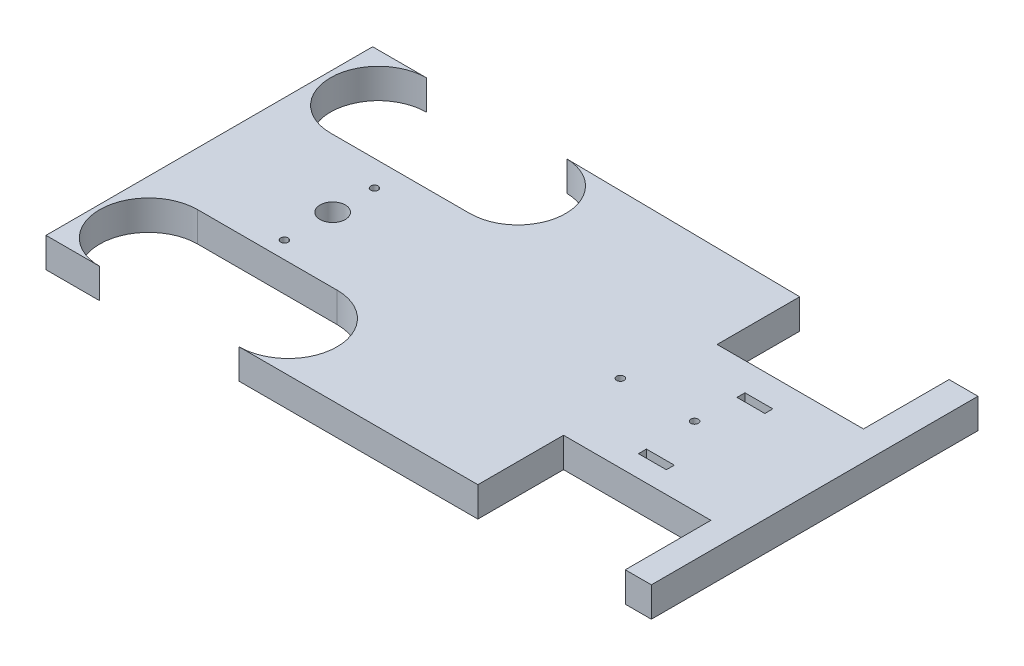
ISO-10303-21;
HEADER;
FILE_DESCRIPTION(('STEP AP214'),'2;1');
FILE_NAME('part.step','',(''),(''),'','','');
FILE_SCHEMA(('AUTOMOTIVE_DESIGN { 1 0 10303 214 1 1 1 1 }'));
ENDSEC;
DATA;
#1=APPLICATION_CONTEXT('core data for automotive mechanical design processes');
#2=APPLICATION_PROTOCOL_DEFINITION('international standard','automotive_design',2000,#1);
#3=PRODUCT_CONTEXT('',#1,'mechanical');
#4=PRODUCT('Part','Part','',(#3));
#5=PRODUCT_RELATED_PRODUCT_CATEGORY('part','',(#4));
#6=PRODUCT_DEFINITION_FORMATION('','',#4);
#7=PRODUCT_DEFINITION_CONTEXT('part definition',#1,'design');
#8=PRODUCT_DEFINITION('design','',#6,#7);
#9=PRODUCT_DEFINITION_SHAPE('','',#8);
#10=(LENGTH_UNIT() NAMED_UNIT(*) SI_UNIT(.MILLI.,.METRE.));
#11=(NAMED_UNIT(*) PLANE_ANGLE_UNIT() SI_UNIT($,.RADIAN.));
#12=(NAMED_UNIT(*) SI_UNIT($,.STERADIAN.) SOLID_ANGLE_UNIT());
#13=UNCERTAINTY_MEASURE_WITH_UNIT(LENGTH_MEASURE(1.E-05),#10,'distance_accuracy_value','');
#14=(GEOMETRIC_REPRESENTATION_CONTEXT(3) GLOBAL_UNCERTAINTY_ASSIGNED_CONTEXT((#13)) GLOBAL_UNIT_ASSIGNED_CONTEXT((#10,
#11,#12)) REPRESENTATION_CONTEXT('',''));
#15=CARTESIAN_POINT('',(0.,0.,0.));
#16=DIRECTION('',(0.,0.,1.));
#17=DIRECTION('',(1.,0.,0.));
#18=AXIS2_PLACEMENT_3D('',#15,#16,#17);
#19=CARTESIAN_POINT('',(0.,4.,6.21194904951244));
#20=DIRECTION('',(0.,0.,1.));
#21=DIRECTION('',(1.,0.,0.));
#22=AXIS2_PLACEMENT_3D('',#19,#20,#21);
#23=PLANE('',#22);
#24=DIRECTION('',(-1.,0.,0.));
#25=VECTOR('',#24,1.);
#26=CARTESIAN_POINT('',(0.,0.,6.21194904951244));
#27=LINE('',#26,#25);
#28=CARTESIAN_POINT('',(-11.8351258503829,0.,6.21194904951244));
#29=VERTEX_POINT('',#28);
#30=CARTESIAN_POINT('',(-30.5325354955565,0.,6.21194904951244));
#31=VERTEX_POINT('',#30);
#32=EDGE_CURVE('E297',#29,#31,#27,.T.);
#33=ORIENTED_EDGE('',*,*,#32,.F.);
#34=DIRECTION('',(0.,-1.,0.));
#35=VECTOR('',#34,1.);
#36=CARTESIAN_POINT('',(-11.8351258503829,4.,6.21194904951244));
#37=LINE('',#36,#35);
#38=CARTESIAN_POINT('',(-11.8351258503829,4.,6.21194904951244));
#39=VERTEX_POINT('',#38);
#40=EDGE_CURVE('E11',#39,#29,#37,.T.);
#41=ORIENTED_EDGE('',*,*,#40,.F.);
#42=DIRECTION('',(-1.,0.,0.));
#43=VECTOR('',#42,1.);
#44=CARTESIAN_POINT('',(0.,4.,6.21194904951244));
#45=LINE('',#44,#43);
#46=CARTESIAN_POINT('',(-30.5325354955565,4.,6.21194904951244));
#47=VERTEX_POINT('',#46);
#48=EDGE_CURVE('E447',#39,#47,#45,.T.);
#49=ORIENTED_EDGE('',*,*,#48,.T.);
#50=DIRECTION('',(0.,-1.,0.));
#51=VECTOR('',#50,1.);
#52=CARTESIAN_POINT('',(-30.5325354955565,4.,6.21194904951244));
#53=LINE('',#52,#51);
#54=EDGE_CURVE('E56',#47,#31,#53,.T.);
#55=ORIENTED_EDGE('',*,*,#54,.T.);
#56=EDGE_LOOP('',(#33,#41,#49,#55));
#57=FACE_BOUND('',#56,.T.);
#58=ADVANCED_FACE('F37',(#57),#23,.T.);
#59=CARTESIAN_POINT('',(-11.8351258503829,4.,12.7885616624354));
#60=DIRECTION('',(0.,-1.,0.));
#61=DIRECTION('',(0.,0.,-1.));
#62=AXIS2_PLACEMENT_3D('',#59,#60,#61);
#63=CYLINDRICAL_SURFACE('',#62,6.57661261292298);
#64=CARTESIAN_POINT('',(-11.8351258503829,0.,12.7885616624354));
#65=DIRECTION('',(0.,1.,0.));
#66=DIRECTION('',(0.,0.,1.));
#67=AXIS2_PLACEMENT_3D('',#64,#65,#66);
#68=CIRCLE('',#67,6.57661261292298);
#69=CARTESIAN_POINT('',(-11.8351258503829,0.,19.3651742753584));
#70=VERTEX_POINT('',#69);
#71=EDGE_CURVE('E299',#29,#70,#68,.F.);
#72=ORIENTED_EDGE('',*,*,#71,.T.);
#73=DIRECTION('',(0.,-1.,0.));
#74=VECTOR('',#73,1.);
#75=CARTESIAN_POINT('',(-11.8351258503829,4.,19.3651742753584));
#76=LINE('',#75,#74);
#77=CARTESIAN_POINT('',(-11.8351258503829,4.,19.3651742753584));
#78=VERTEX_POINT('',#77);
#79=EDGE_CURVE('E47',#78,#70,#76,.T.);
#80=ORIENTED_EDGE('',*,*,#79,.F.);
#81=CARTESIAN_POINT('',(-11.8351258503829,4.,12.7885616624354));
#82=DIRECTION('',(0.,1.,0.));
#83=DIRECTION('',(0.,0.,1.));
#84=AXIS2_PLACEMENT_3D('',#81,#82,#83);
#85=CIRCLE('',#84,6.57661261292298);
#86=EDGE_CURVE('E449',#39,#78,#85,.F.);
#87=ORIENTED_EDGE('',*,*,#86,.F.);
#88=ORIENTED_EDGE('',*,*,#40,.T.);
#89=EDGE_LOOP('',(#72,#80,#87,#88));
#90=FACE_BOUND('',#89,.T.);
#91=ADVANCED_FACE('F509',(#90),#63,.F.);
#92=CARTESIAN_POINT('',(0.,4.,19.3651742753584));
#93=DIRECTION('',(0.,0.,-1.));
#94=DIRECTION('',(-1.,0.,0.));
#95=AXIS2_PLACEMENT_3D('',#92,#93,#94);
#96=PLANE('',#95);
#97=DIRECTION('',(1.,0.,0.));
#98=VECTOR('',#97,1.);
#99=CARTESIAN_POINT('',(0.,0.,19.3651742753584));
#100=LINE('',#99,#98);
#101=CARTESIAN_POINT('',(20.1933701419725,0.,19.3651742753584));
#102=VERTEX_POINT('',#101);
#103=EDGE_CURVE('E302',#70,#102,#100,.T.);
#104=ORIENTED_EDGE('',*,*,#103,.T.);
#105=DIRECTION('',(0.,-1.,0.));
#106=VECTOR('',#105,1.);
#107=CARTESIAN_POINT('',(20.1933701419725,4.,19.3651742753584));
#108=LINE('',#107,#106);
#109=CARTESIAN_POINT('',(20.1933701419725,4.,19.3651742753584));
#110=VERTEX_POINT('',#109);
#111=EDGE_CURVE('E388',#110,#102,#108,.T.);
#112=ORIENTED_EDGE('',*,*,#111,.F.);
#113=DIRECTION('',(1.,0.,0.));
#114=VECTOR('',#113,1.);
#115=CARTESIAN_POINT('',(0.,4.,19.3651742753584));
#116=LINE('',#115,#114);
#117=EDGE_CURVE('E452',#78,#110,#116,.T.);
#118=ORIENTED_EDGE('',*,*,#117,.F.);
#119=ORIENTED_EDGE('',*,*,#79,.T.);
#120=EDGE_LOOP('',(#104,#112,#118,#119));
#121=FACE_BOUND('',#120,.T.);
#122=ADVANCED_FACE('F514',(#121),#96,.F.);
#123=CARTESIAN_POINT('',(20.1933701419725,4.,0.));
#124=DIRECTION('',(1.,0.,0.));
#125=DIRECTION('',(0.,0.,-1.));
#126=AXIS2_PLACEMENT_3D('',#123,#124,#125);
#127=PLANE('',#126);
#128=DIRECTION('',(0.,0.,1.));
#129=VECTOR('',#128,1.);
#130=CARTESIAN_POINT('',(20.1933701419725,0.,0.));
#131=LINE('',#130,#129);
#132=CARTESIAN_POINT('',(20.1933701419725,0.,7.87962263618029));
#133=VERTEX_POINT('',#132);
#134=EDGE_CURVE('E305',#133,#102,#131,.T.);
#135=ORIENTED_EDGE('',*,*,#134,.F.);
#136=DIRECTION('',(0.,-1.,0.));
#137=VECTOR('',#136,1.);
#138=CARTESIAN_POINT('',(20.1933701419725,4.,7.87962263618029));
#139=LINE('',#138,#137);
#140=CARTESIAN_POINT('',(20.1933701419725,4.,7.87962263618029));
#141=VERTEX_POINT('',#140);
#142=EDGE_CURVE('E386',#141,#133,#139,.T.);
#143=ORIENTED_EDGE('',*,*,#142,.F.);
#144=DIRECTION('',(0.,0.,1.));
#145=VECTOR('',#144,1.);
#146=CARTESIAN_POINT('',(20.1933701419725,4.,0.));
#147=LINE('',#146,#145);
#148=EDGE_CURVE('E454',#141,#110,#147,.T.);
#149=ORIENTED_EDGE('',*,*,#148,.T.);
#150=ORIENTED_EDGE('',*,*,#111,.T.);
#151=EDGE_LOOP('',(#135,#143,#149,#150));
#152=FACE_BOUND('',#151,.T.);
#153=ADVANCED_FACE('F794',(#152),#127,.T.);
#154=CARTESIAN_POINT('',(0.,4.,7.87962263618029));
#155=DIRECTION('',(0.,0.,1.));
#156=DIRECTION('',(1.,0.,0.));
#157=AXIS2_PLACEMENT_3D('',#154,#155,#156);
#158=PLANE('',#157);
#159=DIRECTION('',(-1.,0.,0.));
#160=VECTOR('',#159,1.);
#161=CARTESIAN_POINT('',(0.,0.,7.87962263618029));
#162=LINE('',#161,#160);
#163=CARTESIAN_POINT('',(39.9592031954417,0.,7.87962263618029));
#164=VERTEX_POINT('',#163);
#165=EDGE_CURVE('E308',#164,#133,#162,.T.);
#166=ORIENTED_EDGE('',*,*,#165,.F.);
#167=DIRECTION('',(0.,-1.,0.));
#168=VECTOR('',#167,1.);
#169=CARTESIAN_POINT('',(39.9592031954417,4.,7.87962263618029));
#170=LINE('',#169,#168);
#171=CARTESIAN_POINT('',(39.9592031954417,4.,7.87962263618029));
#172=VERTEX_POINT('',#171);
#173=EDGE_CURVE('E384',#172,#164,#170,.T.);
#174=ORIENTED_EDGE('',*,*,#173,.F.);
#175=DIRECTION('',(-1.,0.,0.));
#176=VECTOR('',#175,1.);
#177=CARTESIAN_POINT('',(0.,4.,7.87962263618029));
#178=LINE('',#177,#176);
#179=EDGE_CURVE('E457',#172,#141,#178,.T.);
#180=ORIENTED_EDGE('',*,*,#179,.T.);
#181=ORIENTED_EDGE('',*,*,#142,.T.);
#182=EDGE_LOOP('',(#166,#174,#180,#181));
#183=FACE_BOUND('',#182,.T.);
#184=ADVANCED_FACE('F785',(#183),#158,.T.);
#185=CARTESIAN_POINT('',(39.9592031954417,4.,0.));
#186=DIRECTION('',(1.,0.,0.));
#187=DIRECTION('',(0.,0.,-1.));
#188=AXIS2_PLACEMENT_3D('',#185,#186,#187);
#189=PLANE('',#188);
#190=DIRECTION('',(0.,0.,1.));
#191=VECTOR('',#190,1.);
#192=CARTESIAN_POINT('',(39.9592031954417,0.,0.));
#193=LINE('',#192,#191);
#194=CARTESIAN_POINT('',(39.9592031954418,0.,19.3651742753584));
#195=VERTEX_POINT('',#194);
#196=EDGE_CURVE('E311',#164,#195,#193,.T.);
#197=ORIENTED_EDGE('',*,*,#196,.T.);
#198=DIRECTION('',(0.,-1.,0.));
#199=VECTOR('',#198,1.);
#200=CARTESIAN_POINT('',(39.9592031954418,4.,19.3651742753584));
#201=LINE('',#200,#199);
#202=CARTESIAN_POINT('',(39.9592031954418,4.,19.3651742753584));
#203=VERTEX_POINT('',#202);
#204=EDGE_CURVE('E381',#203,#195,#201,.T.);
#205=ORIENTED_EDGE('',*,*,#204,.F.);
#206=DIRECTION('',(0.,0.,1.));
#207=VECTOR('',#206,1.);
#208=CARTESIAN_POINT('',(39.9592031954417,4.,0.));
#209=LINE('',#208,#207);
#210=EDGE_CURVE('E460',#172,#203,#209,.T.);
#211=ORIENTED_EDGE('',*,*,#210,.F.);
#212=ORIENTED_EDGE('',*,*,#173,.T.);
#213=EDGE_LOOP('',(#197,#205,#211,#212));
#214=FACE_BOUND('',#213,.T.);
#215=ADVANCED_FACE('F776',(#214),#189,.F.);
#216=CARTESIAN_POINT('',(0.,4.,19.3651742753582));
#217=DIRECTION('',(0.,0.,-1.));
#218=DIRECTION('',(-1.,0.,0.));
#219=AXIS2_PLACEMENT_3D('',#216,#217,#218);
#220=PLANE('',#219);
#221=DIRECTION('',(1.,0.,0.));
#222=VECTOR('',#221,1.);
#223=CARTESIAN_POINT('',(0.,0.,19.3651742753582));
#224=LINE('',#223,#222);
#225=CARTESIAN_POINT('',(43.4557855289163,0.,19.3651742753584));
#226=VERTEX_POINT('',#225);
#227=EDGE_CURVE('E314',#195,#226,#224,.T.);
#228=ORIENTED_EDGE('',*,*,#227,.T.);
#229=DIRECTION('',(0.,-1.,0.));
#230=VECTOR('',#229,1.);
#231=CARTESIAN_POINT('',(43.4557855289163,4.,19.3651742753584));
#232=LINE('',#231,#230);
#233=CARTESIAN_POINT('',(43.4557855289163,4.,19.3651742753584));
#234=VERTEX_POINT('',#233);
#235=EDGE_CURVE('E379',#234,#226,#232,.T.);
#236=ORIENTED_EDGE('',*,*,#235,.F.);
#237=DIRECTION('',(1.,0.,0.));
#238=VECTOR('',#237,1.);
#239=CARTESIAN_POINT('',(0.,4.,19.3651742753582));
#240=LINE('',#239,#238);
#241=EDGE_CURVE('E463',#203,#234,#240,.T.);
#242=ORIENTED_EDGE('',*,*,#241,.F.);
#243=ORIENTED_EDGE('',*,*,#204,.T.);
#244=EDGE_LOOP('',(#228,#236,#242,#243));
#245=FACE_BOUND('',#244,.T.);
#246=ADVANCED_FACE('F767',(#245),#220,.F.);
#247=CARTESIAN_POINT('',(43.4557855289163,4.,0.));
#248=DIRECTION('',(1.,0.,0.));
#249=DIRECTION('',(0.,0.,-1.));
#250=AXIS2_PLACEMENT_3D('',#247,#248,#249);
#251=PLANE('',#250);
#252=DIRECTION('',(0.,0.,1.));
#253=VECTOR('',#252,1.);
#254=CARTESIAN_POINT('',(43.4557855289163,0.,0.));
#255=LINE('',#254,#253);
#256=CARTESIAN_POINT('',(43.4557855289163,0.,-24.4401854647627));
#257=VERTEX_POINT('',#256);
#258=EDGE_CURVE('E317',#257,#226,#255,.T.);
#259=ORIENTED_EDGE('',*,*,#258,.F.);
#260=DIRECTION('',(0.,-1.,0.));
#261=VECTOR('',#260,1.);
#262=CARTESIAN_POINT('',(43.4557855289163,4.,-24.4401854647627));
#263=LINE('',#262,#261);
#264=CARTESIAN_POINT('',(43.4557855289163,4.,-24.4401854647627));
#265=VERTEX_POINT('',#264);
#266=EDGE_CURVE('E377',#265,#257,#263,.T.);
#267=ORIENTED_EDGE('',*,*,#266,.F.);
#268=DIRECTION('',(0.,0.,1.));
#269=VECTOR('',#268,1.);
#270=CARTESIAN_POINT('',(43.4557855289163,4.,0.));
#271=LINE('',#270,#269);
#272=EDGE_CURVE('E465',#265,#234,#271,.T.);
#273=ORIENTED_EDGE('',*,*,#272,.T.);
#274=ORIENTED_EDGE('',*,*,#235,.T.);
#275=EDGE_LOOP('',(#259,#267,#273,#274));
#276=FACE_BOUND('',#275,.T.);
#277=ADVANCED_FACE('F758',(#276),#251,.T.);
#278=CARTESIAN_POINT('',(0.,4.,-24.4401854647627));
#279=DIRECTION('',(0.,0.,-1.));
#280=DIRECTION('',(-1.,0.,0.));
#281=AXIS2_PLACEMENT_3D('',#278,#279,#280);
#282=PLANE('',#281);
#283=DIRECTION('',(1.,0.,0.));
#284=VECTOR('',#283,1.);
#285=CARTESIAN_POINT('',(0.,0.,-24.4401854647627));
#286=LINE('',#285,#284);
#287=CARTESIAN_POINT('',(39.5766129964993,0.,-24.4401854647627));
#288=VERTEX_POINT('',#287);
#289=EDGE_CURVE('E320',#288,#257,#286,.T.);
#290=ORIENTED_EDGE('',*,*,#289,.F.);
#291=DIRECTION('',(0.,-1.,0.));
#292=VECTOR('',#291,1.);
#293=CARTESIAN_POINT('',(39.5766129964993,4.,-24.4401854647627));
#294=LINE('',#293,#292);
#295=CARTESIAN_POINT('',(39.5766129964993,4.,-24.4401854647627));
#296=VERTEX_POINT('',#295);
#297=EDGE_CURVE('E375',#296,#288,#294,.T.);
#298=ORIENTED_EDGE('',*,*,#297,.F.);
#299=DIRECTION('',(1.,0.,0.));
#300=VECTOR('',#299,1.);
#301=CARTESIAN_POINT('',(0.,4.,-24.4401854647627));
#302=LINE('',#301,#300);
#303=EDGE_CURVE('E468',#296,#265,#302,.T.);
#304=ORIENTED_EDGE('',*,*,#303,.T.);
#305=ORIENTED_EDGE('',*,*,#266,.T.);
#306=EDGE_LOOP('',(#290,#298,#304,#305));
#307=FACE_BOUND('',#306,.T.);
#308=ADVANCED_FACE('F749',(#307),#282,.T.);
#309=CARTESIAN_POINT('',(39.5766129964993,4.,0.));
#310=DIRECTION('',(1.,0.,0.));
#311=DIRECTION('',(0.,0.,-1.));
#312=AXIS2_PLACEMENT_3D('',#309,#310,#311);
#313=PLANE('',#312);
#314=DIRECTION('',(0.,0.,1.));
#315=VECTOR('',#314,1.);
#316=CARTESIAN_POINT('',(39.5766129964993,0.,0.));
#317=LINE('',#316,#315);
#318=CARTESIAN_POINT('',(39.5766129964993,0.,-12.9607689534621));
#319=VERTEX_POINT('',#318);
#320=EDGE_CURVE('E323',#288,#319,#317,.T.);
#321=ORIENTED_EDGE('',*,*,#320,.T.);
#322=DIRECTION('',(0.,-1.,0.));
#323=VECTOR('',#322,1.);
#324=CARTESIAN_POINT('',(39.5766129964993,4.,-12.9607689534621));
#325=LINE('',#324,#323);
#326=CARTESIAN_POINT('',(39.5766129964993,4.,-12.9607689534621));
#327=VERTEX_POINT('',#326);
#328=EDGE_CURVE('E372',#327,#319,#325,.T.);
#329=ORIENTED_EDGE('',*,*,#328,.F.);
#330=DIRECTION('',(0.,0.,1.));
#331=VECTOR('',#330,1.);
#332=CARTESIAN_POINT('',(39.5766129964993,4.,0.));
#333=LINE('',#332,#331);
#334=EDGE_CURVE('E471',#296,#327,#333,.T.);
#335=ORIENTED_EDGE('',*,*,#334,.F.);
#336=ORIENTED_EDGE('',*,*,#297,.T.);
#337=EDGE_LOOP('',(#321,#329,#335,#336));
#338=FACE_BOUND('',#337,.T.);
#339=ADVANCED_FACE('F740',(#338),#313,.F.);
#340=CARTESIAN_POINT('',(0.,4.,-12.9607689534621));
#341=DIRECTION('',(0.,0.,1.));
#342=DIRECTION('',(1.,0.,0.));
#343=AXIS2_PLACEMENT_3D('',#340,#341,#342);
#344=PLANE('',#343);
#345=DIRECTION('',(-1.,0.,0.));
#346=VECTOR('',#345,1.);
#347=CARTESIAN_POINT('',(0.,0.,-12.9607689534621));
#348=LINE('',#347,#346);
#349=CARTESIAN_POINT('',(19.9504705464123,0.,-12.9607689534621));
#350=VERTEX_POINT('',#349);
#351=EDGE_CURVE('E326',#319,#350,#348,.T.);
#352=ORIENTED_EDGE('',*,*,#351,.T.);
#353=DIRECTION('',(0.,-1.,0.));
#354=VECTOR('',#353,1.);
#355=CARTESIAN_POINT('',(19.9504705464123,4.,-12.9607689534621));
#356=LINE('',#355,#354);
#357=CARTESIAN_POINT('',(19.9504705464123,4.,-12.9607689534621));
#358=VERTEX_POINT('',#357);
#359=EDGE_CURVE('E370',#358,#350,#356,.T.);
#360=ORIENTED_EDGE('',*,*,#359,.F.);
#361=DIRECTION('',(-1.,0.,0.));
#362=VECTOR('',#361,1.);
#363=CARTESIAN_POINT('',(0.,4.,-12.9607689534621));
#364=LINE('',#363,#362);
#365=EDGE_CURVE('E474',#327,#358,#364,.T.);
#366=ORIENTED_EDGE('',*,*,#365,.F.);
#367=ORIENTED_EDGE('',*,*,#328,.T.);
#368=EDGE_LOOP('',(#352,#360,#366,#367));
#369=FACE_BOUND('',#368,.T.);
#370=ADVANCED_FACE('F731',(#369),#344,.F.);
#371=CARTESIAN_POINT('',(19.9504705464123,4.,0.));
#372=DIRECTION('',(1.,0.,0.));
#373=DIRECTION('',(0.,0.,-1.));
#374=AXIS2_PLACEMENT_3D('',#371,#372,#373);
#375=PLANE('',#374);
#376=DIRECTION('',(0.,0.,1.));
#377=VECTOR('',#376,1.);
#378=CARTESIAN_POINT('',(19.9504705464123,0.,0.));
#379=LINE('',#378,#377);
#380=CARTESIAN_POINT('',(19.9504705464123,0.,-24.0395266866518));
#381=VERTEX_POINT('',#380);
#382=EDGE_CURVE('E329',#381,#350,#379,.T.);
#383=ORIENTED_EDGE('',*,*,#382,.F.);
#384=DIRECTION('',(0.,-1.,0.));
#385=VECTOR('',#384,1.);
#386=CARTESIAN_POINT('',(19.9504705464123,4.,-24.0395266866518));
#387=LINE('',#386,#385);
#388=CARTESIAN_POINT('',(19.9504705464123,4.,-24.0395266866518));
#389=VERTEX_POINT('',#388);
#390=EDGE_CURVE('E368',#389,#381,#387,.T.);
#391=ORIENTED_EDGE('',*,*,#390,.F.);
#392=DIRECTION('',(0.,0.,1.));
#393=VECTOR('',#392,1.);
#394=CARTESIAN_POINT('',(19.9504705464123,4.,0.));
#395=LINE('',#394,#393);
#396=EDGE_CURVE('E476',#389,#358,#395,.T.);
#397=ORIENTED_EDGE('',*,*,#396,.T.);
#398=ORIENTED_EDGE('',*,*,#359,.T.);
#399=EDGE_LOOP('',(#383,#391,#397,#398));
#400=FACE_BOUND('',#399,.T.);
#401=ADVANCED_FACE('F722',(#400),#375,.T.);
#402=CARTESIAN_POINT('',(0.306140474276511,4.,-24.2871442926031));
#403=DIRECTION('',(-0.0126040407469354,0.,0.999920565923539));
#404=DIRECTION('',(0.999920565923539,0.,0.0126040407469354));
#405=AXIS2_PLACEMENT_3D('',#402,#403,#404);
#406=PLANE('',#405);
#407=DIRECTION('',(-0.999920565923539,0.,-0.0126040407469354));
#408=VECTOR('',#407,1.);
#409=CARTESIAN_POINT('',(0.306140474276511,0.,-24.2871442926031));
#410=LINE('',#409,#408);
#411=CARTESIAN_POINT('',(-11.6731907011898,0.,-24.4381442654031));
#412=VERTEX_POINT('',#411);
#413=EDGE_CURVE('E332',#381,#412,#410,.T.);
#414=ORIENTED_EDGE('',*,*,#413,.T.);
#415=DIRECTION('',(0.,-1.,0.));
#416=VECTOR('',#415,1.);
#417=CARTESIAN_POINT('',(-11.6731907011898,4.,-24.4381442654031));
#418=LINE('',#417,#416);
#419=CARTESIAN_POINT('',(-11.6731907011898,4.,-24.4381442654031));
#420=VERTEX_POINT('',#419);
#421=EDGE_CURVE('E365',#420,#412,#418,.T.);
#422=ORIENTED_EDGE('',*,*,#421,.F.);
#423=DIRECTION('',(-0.999920565923539,0.,-0.0126040407469354));
#424=VECTOR('',#423,1.);
#425=CARTESIAN_POINT('',(0.306140474276511,4.,-24.2871442926031));
#426=LINE('',#425,#424);
#427=EDGE_CURVE('E479',#389,#420,#426,.T.);
#428=ORIENTED_EDGE('',*,*,#427,.F.);
#429=ORIENTED_EDGE('',*,*,#390,.T.);
#430=EDGE_LOOP('',(#414,#422,#428,#429));
#431=FACE_BOUND('',#430,.T.);
#432=ADVANCED_FACE('F713',(#431),#406,.F.);
#433=CARTESIAN_POINT('',(-11.8351258503829,4.,-18.0157372804347));
#434=DIRECTION('',(0.,-1.,0.));
#435=DIRECTION('',(0.,0.,-1.));
#436=AXIS2_PLACEMENT_3D('',#433,#434,#435);
#437=CYLINDRICAL_SURFACE('',#436,6.42444818432794);
#438=CARTESIAN_POINT('',(-11.8351258503829,0.,-18.0157372804347));
#439=DIRECTION('',(0.,1.,0.));
#440=DIRECTION('',(0.,0.,1.));
#441=AXIS2_PLACEMENT_3D('',#438,#439,#440);
#442=CIRCLE('',#441,6.42444818432794);
#443=CARTESIAN_POINT('',(-11.8351258503829,0.,-11.5912890961068));
#444=VERTEX_POINT('',#443);
#445=EDGE_CURVE('E335',#412,#444,#442,.F.);
#446=ORIENTED_EDGE('',*,*,#445,.T.);
#447=DIRECTION('',(0.,-1.,0.));
#448=VECTOR('',#447,1.);
#449=CARTESIAN_POINT('',(-11.8351258503829,4.,-11.5912890961068));
#450=LINE('',#449,#448);
#451=CARTESIAN_POINT('',(-11.8351258503829,4.,-11.5912890961068));
#452=VERTEX_POINT('',#451);
#453=EDGE_CURVE('E362',#452,#444,#450,.T.);
#454=ORIENTED_EDGE('',*,*,#453,.F.);
#455=CARTESIAN_POINT('',(-11.8351258503829,4.,-18.0157372804347));
#456=DIRECTION('',(0.,1.,0.));
#457=DIRECTION('',(0.,0.,1.));
#458=AXIS2_PLACEMENT_3D('',#455,#456,#457);
#459=CIRCLE('',#458,6.42444818432794);
#460=EDGE_CURVE('E482',#420,#452,#459,.F.);
#461=ORIENTED_EDGE('',*,*,#460,.F.);
#462=ORIENTED_EDGE('',*,*,#421,.T.);
#463=EDGE_LOOP('',(#446,#454,#461,#462));
#464=FACE_BOUND('',#463,.T.);
#465=ADVANCED_FACE('F705',(#464),#437,.F.);
#466=CARTESIAN_POINT('',(0.,4.,-11.5912890961068));
#467=DIRECTION('',(0.,0.,1.));
#468=DIRECTION('',(1.,0.,0.));
#469=AXIS2_PLACEMENT_3D('',#466,#467,#468);
#470=PLANE('',#469);
#471=DIRECTION('',(-1.,0.,0.));
#472=VECTOR('',#471,1.);
#473=CARTESIAN_POINT('',(0.,0.,-11.5912890961068));
#474=LINE('',#473,#472);
#475=CARTESIAN_POINT('',(-30.5325354955565,0.,-11.5912890961068));
#476=VERTEX_POINT('',#475);
#477=EDGE_CURVE('E338',#444,#476,#474,.T.);
#478=ORIENTED_EDGE('',*,*,#477,.T.);
#479=DIRECTION('',(0.,-1.,0.));
#480=VECTOR('',#479,1.);
#481=CARTESIAN_POINT('',(-30.5325354955565,4.,-11.5912890961068));
#482=LINE('',#481,#480);
#483=CARTESIAN_POINT('',(-30.5325354955565,4.,-11.5912890961068));
#484=VERTEX_POINT('',#483);
#485=EDGE_CURVE('E360',#484,#476,#482,.T.);
#486=ORIENTED_EDGE('',*,*,#485,.F.);
#487=DIRECTION('',(-1.,0.,0.));
#488=VECTOR('',#487,1.);
#489=CARTESIAN_POINT('',(0.,4.,-11.5912890961068));
#490=LINE('',#489,#488);
#491=EDGE_CURVE('E485',#452,#484,#490,.T.);
#492=ORIENTED_EDGE('',*,*,#491,.F.);
#493=ORIENTED_EDGE('',*,*,#453,.T.);
#494=EDGE_LOOP('',(#478,#486,#492,#493));
#495=FACE_BOUND('',#494,.T.);
#496=ADVANCED_FACE('F495',(#495),#470,.F.);
#497=CARTESIAN_POINT('',(-30.5325354955565,4.,-18.0157372804347));
#498=DIRECTION('',(0.,-1.,0.));
#499=DIRECTION('',(0.,0.,-1.));
#500=AXIS2_PLACEMENT_3D('',#497,#498,#499);
#501=CYLINDRICAL_SURFACE('',#500,6.42444818432794);
#502=CARTESIAN_POINT('',(-30.5325354955565,0.,-18.0157372804347));
#503=DIRECTION('',(0.,1.,0.));
#504=DIRECTION('',(0.,0.,1.));
#505=AXIS2_PLACEMENT_3D('',#502,#503,#504);
#506=CIRCLE('',#505,6.42444818432794);
#507=CARTESIAN_POINT('',(-30.5325354955565,0.,-24.4401854647627));
#508=VERTEX_POINT('',#507);
#509=EDGE_CURVE('E341',#508,#476,#506,.T.);
#510=ORIENTED_EDGE('',*,*,#509,.F.);
#511=DIRECTION('',(0.,-1.,0.));
#512=VECTOR('',#511,1.);
#513=CARTESIAN_POINT('',(-30.5325354955565,4.,-24.4401854647627));
#514=LINE('',#513,#512);
#515=CARTESIAN_POINT('',(-30.5325354955565,4.,-24.4401854647627));
#516=VERTEX_POINT('',#515);
#517=EDGE_CURVE('E358',#516,#508,#514,.T.);
#518=ORIENTED_EDGE('',*,*,#517,.F.);
#519=CARTESIAN_POINT('',(-30.5325354955565,4.,-18.0157372804347));
#520=DIRECTION('',(0.,1.,0.));
#521=DIRECTION('',(0.,0.,1.));
#522=AXIS2_PLACEMENT_3D('',#519,#520,#521);
#523=CIRCLE('',#522,6.42444818432794);
#524=EDGE_CURVE('E487',#516,#484,#523,.T.);
#525=ORIENTED_EDGE('',*,*,#524,.T.);
#526=ORIENTED_EDGE('',*,*,#485,.T.);
#527=EDGE_LOOP('',(#510,#518,#525,#526));
#528=FACE_BOUND('',#527,.T.);
#529=ADVANCED_FACE('F491',(#528),#501,.F.);
#530=CARTESIAN_POINT('',(0.,4.,-24.4401854647627));
#531=DIRECTION('',(0.,0.,1.));
#532=DIRECTION('',(1.,0.,0.));
#533=AXIS2_PLACEMENT_3D('',#530,#531,#532);
#534=PLANE('',#533);
#535=DIRECTION('',(-1.,0.,0.));
#536=VECTOR('',#535,1.);
#537=CARTESIAN_POINT('',(0.,0.,-24.4401854647627));
#538=LINE('',#537,#536);
#539=CARTESIAN_POINT('',(-37.7229167297788,0.,-24.4401854647627));
#540=VERTEX_POINT('',#539);
#541=EDGE_CURVE('E344',#508,#540,#538,.T.);
#542=ORIENTED_EDGE('',*,*,#541,.T.);
#543=DIRECTION('',(0.,-1.,0.));
#544=VECTOR('',#543,1.);
#545=CARTESIAN_POINT('',(-37.7229167297788,4.,-24.4401854647627));
#546=LINE('',#545,#544);
#547=CARTESIAN_POINT('',(-37.7229167297788,4.,-24.4401854647627));
#548=VERTEX_POINT('',#547);
#549=EDGE_CURVE('E249',#548,#540,#546,.T.);
#550=ORIENTED_EDGE('',*,*,#549,.F.);
#551=DIRECTION('',(-1.,0.,0.));
#552=VECTOR('',#551,1.);
#553=CARTESIAN_POINT('',(0.,4.,-24.4401854647627));
#554=LINE('',#553,#552);
#555=EDGE_CURVE('E238',#516,#548,#554,.T.);
#556=ORIENTED_EDGE('',*,*,#555,.F.);
#557=ORIENTED_EDGE('',*,*,#517,.T.);
#558=EDGE_LOOP('',(#542,#550,#556,#557));
#559=FACE_BOUND('',#558,.T.);
#560=ADVANCED_FACE('F499',(#559),#534,.F.);
#561=CARTESIAN_POINT('',(-37.7229167297788,4.,0.));
#562=DIRECTION('',(1.,0.,0.));
#563=DIRECTION('',(0.,0.,-1.));
#564=AXIS2_PLACEMENT_3D('',#561,#562,#563);
#565=PLANE('',#564);
#566=DIRECTION('',(0.,0.,1.));
#567=VECTOR('',#566,1.);
#568=CARTESIAN_POINT('',(-37.7229167297788,0.,0.));
#569=LINE('',#568,#567);
#570=CARTESIAN_POINT('',(-37.7229167297788,0.,19.3651742753584));
#571=VERTEX_POINT('',#570);
#572=EDGE_CURVE('E246',#540,#571,#569,.T.);
#573=ORIENTED_EDGE('',*,*,#572,.T.);
#574=DIRECTION('',(0.,-1.,0.));
#575=VECTOR('',#574,1.);
#576=CARTESIAN_POINT('',(-37.7229167297788,4.,19.3651742753584));
#577=LINE('',#576,#575);
#578=CARTESIAN_POINT('',(-37.7229167297788,4.,19.3651742753584));
#579=VERTEX_POINT('',#578);
#580=EDGE_CURVE('E244',#579,#571,#577,.T.);
#581=ORIENTED_EDGE('',*,*,#580,.F.);
#582=DIRECTION('',(0.,0.,1.));
#583=VECTOR('',#582,1.);
#584=CARTESIAN_POINT('',(-37.7229167297788,4.,0.));
#585=LINE('',#584,#583);
#586=EDGE_CURVE('E229',#548,#579,#585,.T.);
#587=ORIENTED_EDGE('',*,*,#586,.F.);
#588=ORIENTED_EDGE('',*,*,#549,.T.);
#589=EDGE_LOOP('',(#573,#581,#587,#588));
#590=FACE_BOUND('',#589,.T.);
#591=ADVANCED_FACE('F245',(#590),#565,.F.);
#592=CARTESIAN_POINT('',(0.,4.,19.3651742753584));
#593=DIRECTION('',(0.,0.,1.));
#594=DIRECTION('',(1.,0.,0.));
#595=AXIS2_PLACEMENT_3D('',#592,#593,#594);
#596=PLANE('',#595);
#597=DIRECTION('',(-1.,0.,0.));
#598=VECTOR('',#597,1.);
#599=CARTESIAN_POINT('',(0.,0.,19.3651742753584));
#600=LINE('',#599,#598);
#601=CARTESIAN_POINT('',(-30.5325354955565,0.,19.3651742753584));
#602=VERTEX_POINT('',#601);
#603=EDGE_CURVE('E348',#602,#571,#600,.T.);
#604=ORIENTED_EDGE('',*,*,#603,.F.);
#605=DIRECTION('',(0.,-1.,0.));
#606=VECTOR('',#605,1.);
#607=CARTESIAN_POINT('',(-30.5325354955565,4.,19.3651742753584));
#608=LINE('',#607,#606);
#609=CARTESIAN_POINT('',(-30.5325354955565,4.,19.3651742753584));
#610=VERTEX_POINT('',#609);
#611=EDGE_CURVE('E141',#610,#602,#608,.T.);
#612=ORIENTED_EDGE('',*,*,#611,.F.);
#613=DIRECTION('',(-1.,0.,0.));
#614=VECTOR('',#613,1.);
#615=CARTESIAN_POINT('',(0.,4.,19.3651742753584));
#616=LINE('',#615,#614);
#617=EDGE_CURVE('E235',#610,#579,#616,.T.);
#618=ORIENTED_EDGE('',*,*,#617,.T.);
#619=ORIENTED_EDGE('',*,*,#580,.T.);
#620=EDGE_LOOP('',(#604,#612,#618,#619));
#621=FACE_BOUND('',#620,.T.);
#622=ADVANCED_FACE('F251',(#621),#596,.T.);
#623=CARTESIAN_POINT('',(27.3596908875195,4.,0.));
#624=DIRECTION('',(1.,0.,0.));
#625=DIRECTION('',(0.,0.,-1.));
#626=AXIS2_PLACEMENT_3D('',#623,#624,#625);
#627=PLANE('',#626);
#628=DIRECTION('',(0.,0.,1.));
#629=VECTOR('',#628,1.);
#630=CARTESIAN_POINT('',(27.3596908875195,0.,0.));
#631=LINE('',#630,#629);
#632=CARTESIAN_POINT('',(27.3596908875195,0.,3.92621021245652));
#633=VERTEX_POINT('',#632);
#634=CARTESIAN_POINT('',(27.3596908875195,0.,4.99463362075215));
#635=VERTEX_POINT('',#634);
#636=EDGE_CURVE('E282',#633,#635,#631,.T.);
#637=ORIENTED_EDGE('',*,*,#636,.F.);
#638=DIRECTION('',(0.,-1.,0.));
#639=VECTOR('',#638,1.);
#640=CARTESIAN_POINT('',(27.3596908875195,4.,3.92621021245652));
#641=LINE('',#640,#639);
#642=CARTESIAN_POINT('',(27.3596908875195,4.,3.92621021245652));
#643=VERTEX_POINT('',#642);
#644=EDGE_CURVE('E355',#643,#633,#641,.T.);
#645=ORIENTED_EDGE('',*,*,#644,.F.);
#646=DIRECTION('',(0.,0.,1.));
#647=VECTOR('',#646,1.);
#648=CARTESIAN_POINT('',(27.3596908875195,4.,0.));
#649=LINE('',#648,#647);
#650=CARTESIAN_POINT('',(27.3596908875195,4.,4.99463362075215));
#651=VERTEX_POINT('',#650);
#652=EDGE_CURVE('E426',#643,#651,#649,.T.);
#653=ORIENTED_EDGE('',*,*,#652,.T.);
#654=DIRECTION('',(0.,-1.,0.));
#655=VECTOR('',#654,1.);
#656=CARTESIAN_POINT('',(27.3596908875195,4.,4.99463362075215));
#657=LINE('',#656,#655);
#658=EDGE_CURVE('E392',#651,#635,#657,.T.);
#659=ORIENTED_EDGE('',*,*,#658,.T.);
#660=EDGE_LOOP('',(#637,#645,#653,#659));
#661=FACE_BOUND('',#660,.T.);
#662=ADVANCED_FACE('F534',(#661),#627,.T.);
#663=CARTESIAN_POINT('',(0.,4.,3.92621021245653));
#664=DIRECTION('',(0.,0.,1.));
#665=DIRECTION('',(1.,0.,0.));
#666=AXIS2_PLACEMENT_3D('',#663,#664,#665);
#667=PLANE('',#666);
#668=DIRECTION('',(-1.,0.,0.));
#669=VECTOR('',#668,1.);
#670=CARTESIAN_POINT('',(0.,0.,3.92621021245653));
#671=LINE('',#670,#669);
#672=CARTESIAN_POINT('',(31.0991728165542,0.,3.92621021245652));
#673=VERTEX_POINT('',#672);
#674=EDGE_CURVE('E285',#673,#633,#671,.T.);
#675=ORIENTED_EDGE('',*,*,#674,.F.);
#676=DIRECTION('',(0.,-1.,0.));
#677=VECTOR('',#676,1.);
#678=CARTESIAN_POINT('',(31.0991728165542,4.,3.92621021245652));
#679=LINE('',#678,#677);
#680=CARTESIAN_POINT('',(31.0991728165542,4.,3.92621021245652));
#681=VERTEX_POINT('',#680);
#682=EDGE_CURVE('E397',#681,#673,#679,.T.);
#683=ORIENTED_EDGE('',*,*,#682,.F.);
#684=DIRECTION('',(-1.,0.,0.));
#685=VECTOR('',#684,1.);
#686=CARTESIAN_POINT('',(0.,4.,3.92621021245653));
#687=LINE('',#686,#685);
#688=EDGE_CURVE('E436',#681,#643,#687,.T.);
#689=ORIENTED_EDGE('',*,*,#688,.T.);
#690=ORIENTED_EDGE('',*,*,#644,.T.);
#691=EDGE_LOOP('',(#675,#683,#689,#690));
#692=FACE_BOUND('',#691,.T.);
#693=ADVANCED_FACE('F530',(#692),#667,.T.);
#694=CARTESIAN_POINT('',(31.0991728165542,4.,0.));
#695=DIRECTION('',(1.,0.,0.));
#696=DIRECTION('',(0.,0.,-1.));
#697=AXIS2_PLACEMENT_3D('',#694,#695,#696);
#698=PLANE('',#697);
#699=DIRECTION('',(0.,0.,1.));
#700=VECTOR('',#699,1.);
#701=CARTESIAN_POINT('',(31.0991728165542,0.,0.));
#702=LINE('',#701,#700);
#703=CARTESIAN_POINT('',(31.0991728165542,0.,4.99463362075215));
#704=VERTEX_POINT('',#703);
#705=EDGE_CURVE('E288',#673,#704,#702,.T.);
#706=ORIENTED_EDGE('',*,*,#705,.T.);
#707=DIRECTION('',(0.,-1.,0.));
#708=VECTOR('',#707,1.);
#709=CARTESIAN_POINT('',(31.0991728165542,4.,4.99463362075215));
#710=LINE('',#709,#708);
#711=CARTESIAN_POINT('',(31.0991728165542,4.,4.99463362075215));
#712=VERTEX_POINT('',#711);
#713=EDGE_CURVE('E394',#712,#704,#710,.T.);
#714=ORIENTED_EDGE('',*,*,#713,.F.);
#715=DIRECTION('',(0.,0.,1.));
#716=VECTOR('',#715,1.);
#717=CARTESIAN_POINT('',(31.0991728165542,4.,0.));
#718=LINE('',#717,#716);
#719=EDGE_CURVE('E439',#681,#712,#718,.T.);
#720=ORIENTED_EDGE('',*,*,#719,.F.);
#721=ORIENTED_EDGE('',*,*,#682,.T.);
#722=EDGE_LOOP('',(#706,#714,#720,#721));
#723=FACE_BOUND('',#722,.T.);
#724=ADVANCED_FACE('F527',(#723),#698,.F.);
#725=CARTESIAN_POINT('',(27.4294344044818,4.,0.));
#726=DIRECTION('',(1.,0.,0.));
#727=DIRECTION('',(0.,0.,-1.));
#728=AXIS2_PLACEMENT_3D('',#725,#726,#727);
#729=PLANE('',#728);
#730=DIRECTION('',(0.,0.,1.));
#731=VECTOR('',#730,1.);
#732=CARTESIAN_POINT('',(27.4294344044818,0.,0.));
#733=LINE('',#732,#731);
#734=CARTESIAN_POINT('',(27.4294344044818,0.,-9.21515189654985));
#735=VERTEX_POINT('',#734);
#736=CARTESIAN_POINT('',(27.4294344044818,0.,-8.14672848825422));
#737=VERTEX_POINT('',#736);
#738=EDGE_CURVE('E270',#735,#737,#733,.T.);
#739=ORIENTED_EDGE('',*,*,#738,.F.);
#740=DIRECTION('',(0.,-1.,0.));
#741=VECTOR('',#740,1.);
#742=CARTESIAN_POINT('',(27.4294344044818,4.,-9.21515189654985));
#743=LINE('',#742,#741);
#744=CARTESIAN_POINT('',(27.4294344044818,4.,-9.21515189654985));
#745=VERTEX_POINT('',#744);
#746=EDGE_CURVE('E41',#745,#735,#743,.T.);
#747=ORIENTED_EDGE('',*,*,#746,.F.);
#748=DIRECTION('',(0.,0.,1.));
#749=VECTOR('',#748,1.);
#750=CARTESIAN_POINT('',(27.4294344044818,4.,0.));
#751=LINE('',#750,#749);
#752=CARTESIAN_POINT('',(27.4294344044818,4.,-8.14672848825422));
#753=VERTEX_POINT('',#752);
#754=EDGE_CURVE('E430',#745,#753,#751,.T.);
#755=ORIENTED_EDGE('',*,*,#754,.T.);
#756=DIRECTION('',(0.,-1.,0.));
#757=VECTOR('',#756,1.);
#758=CARTESIAN_POINT('',(27.4294344044818,4.,-8.14672848825422));
#759=LINE('',#758,#757);
#760=EDGE_CURVE('E254',#753,#737,#759,.T.);
#761=ORIENTED_EDGE('',*,*,#760,.T.);
#762=EDGE_LOOP('',(#739,#747,#755,#761));
#763=FACE_BOUND('',#762,.T.);
#764=ADVANCED_FACE('F413',(#763),#729,.T.);
#765=CARTESIAN_POINT('',(0.,4.,-9.21515189654985));
#766=DIRECTION('',(0.,0.,1.));
#767=DIRECTION('',(1.,0.,0.));
#768=AXIS2_PLACEMENT_3D('',#765,#766,#767);
#769=PLANE('',#768);
#770=DIRECTION('',(-1.,0.,0.));
#771=VECTOR('',#770,1.);
#772=CARTESIAN_POINT('',(0.,0.,-9.21515189654985));
#773=LINE('',#772,#771);
#774=CARTESIAN_POINT('',(31.1689163335165,0.,-9.21515189654985));
#775=VERTEX_POINT('',#774);
#776=EDGE_CURVE('E273',#775,#735,#773,.T.);
#777=ORIENTED_EDGE('',*,*,#776,.F.);
#778=DIRECTION('',(0.,-1.,0.));
#779=VECTOR('',#778,1.);
#780=CARTESIAN_POINT('',(31.1689163335165,4.,-9.21515189654985));
#781=LINE('',#780,#779);
#782=CARTESIAN_POINT('',(31.1689163335165,4.,-9.21515189654985));
#783=VERTEX_POINT('',#782);
#784=EDGE_CURVE('E403',#783,#775,#781,.T.);
#785=ORIENTED_EDGE('',*,*,#784,.F.);
#786=DIRECTION('',(-1.,0.,0.));
#787=VECTOR('',#786,1.);
#788=CARTESIAN_POINT('',(0.,4.,-9.21515189654985));
#789=LINE('',#788,#787);
#790=EDGE_CURVE('E412',#783,#745,#789,.T.);
#791=ORIENTED_EDGE('',*,*,#790,.T.);
#792=ORIENTED_EDGE('',*,*,#746,.T.);
#793=EDGE_LOOP('',(#777,#785,#791,#792));
#794=FACE_BOUND('',#793,.T.);
#795=ADVANCED_FACE('F410',(#794),#769,.T.);
#796=CARTESIAN_POINT('',(31.1689163335165,4.,0.));
#797=DIRECTION('',(1.,0.,0.));
#798=DIRECTION('',(0.,0.,-1.));
#799=AXIS2_PLACEMENT_3D('',#796,#797,#798);
#800=PLANE('',#799);
#801=DIRECTION('',(0.,0.,1.));
#802=VECTOR('',#801,1.);
#803=CARTESIAN_POINT('',(31.1689163335165,0.,0.));
#804=LINE('',#803,#802);
#805=CARTESIAN_POINT('',(31.1689163335165,0.,-8.14672848825422));
#806=VERTEX_POINT('',#805);
#807=EDGE_CURVE('E276',#775,#806,#804,.T.);
#808=ORIENTED_EDGE('',*,*,#807,.T.);
#809=DIRECTION('',(0.,-1.,0.));
#810=VECTOR('',#809,1.);
#811=CARTESIAN_POINT('',(31.1689163335165,4.,-8.14672848825422));
#812=LINE('',#811,#810);
#813=CARTESIAN_POINT('',(31.1689163335165,4.,-8.14672848825422));
#814=VERTEX_POINT('',#813);
#815=EDGE_CURVE('E401',#814,#806,#812,.T.);
#816=ORIENTED_EDGE('',*,*,#815,.F.);
#817=DIRECTION('',(0.,0.,1.));
#818=VECTOR('',#817,1.);
#819=CARTESIAN_POINT('',(31.1689163335165,4.,0.));
#820=LINE('',#819,#818);
#821=EDGE_CURVE('E421',#783,#814,#820,.T.);
#822=ORIENTED_EDGE('',*,*,#821,.F.);
#823=ORIENTED_EDGE('',*,*,#784,.T.);
#824=EDGE_LOOP('',(#808,#816,#822,#823));
#825=FACE_BOUND('',#824,.T.);
#826=ADVANCED_FACE('F419',(#825),#800,.F.);
#827=CARTESIAN_POINT('',(-21.1838306729697,4.,-2.53750559470214));
#828=DIRECTION('',(0.,-1.,0.));
#829=DIRECTION('',(0.,0.,-1.));
#830=AXIS2_PLACEMENT_3D('',#827,#828,#829);
#831=CYLINDRICAL_SURFACE('',#830,1.6957200348634);
#832=CARTESIAN_POINT('',(-21.1838306729697,4.,-2.53750559470214));
#833=DIRECTION('',(0.,1.,0.));
#834=DIRECTION('',(0.,0.,1.));
#835=AXIS2_PLACEMENT_3D('',#832,#833,#834);
#836=CIRCLE('',#835,1.6957200348634);
#837=CARTESIAN_POINT('',(-21.1838306729697,4.,-0.841785559838736));
#838=VERTEX_POINT('',#837);
#839=EDGE_CURVE('E444',#838,#838,#836,.T.);
#840=ORIENTED_EDGE('',*,*,#839,.T.);
#841=EDGE_LOOP('',(#840));
#842=FACE_BOUND('',#841,.T.);
#843=CARTESIAN_POINT('',(-21.1838306729697,0.,-2.53750559470214));
#844=DIRECTION('',(0.,1.,0.));
#845=DIRECTION('',(0.,0.,1.));
#846=AXIS2_PLACEMENT_3D('',#843,#844,#845);
#847=CIRCLE('',#846,1.6957200348634);
#848=CARTESIAN_POINT('',(-21.1838306729697,0.,-0.841785559838736));
#849=VERTEX_POINT('',#848);
#850=EDGE_CURVE('E294',#849,#849,#847,.T.);
#851=ORIENTED_EDGE('',*,*,#850,.F.);
#852=EDGE_LOOP('',(#851));
#853=FACE_BOUND('',#852,.T.);
#854=ADVANCED_FACE('F519',(#842,#853),#831,.F.);
#855=CARTESIAN_POINT('',(0.,4.,4.99463362075215));
#856=DIRECTION('',(0.,0.,1.));
#857=DIRECTION('',(1.,0.,0.));
#858=AXIS2_PLACEMENT_3D('',#855,#856,#857);
#859=PLANE('',#858);
#860=DIRECTION('',(-1.,0.,0.));
#861=VECTOR('',#860,1.);
#862=CARTESIAN_POINT('',(0.,0.,4.99463362075215));
#863=LINE('',#862,#861);
#864=EDGE_CURVE('E291',#704,#635,#863,.T.);
#865=ORIENTED_EDGE('',*,*,#864,.T.);
#866=ORIENTED_EDGE('',*,*,#658,.F.);
#867=DIRECTION('',(-1.,0.,0.));
#868=VECTOR('',#867,1.);
#869=CARTESIAN_POINT('',(0.,4.,4.99463362075215));
#870=LINE('',#869,#868);
#871=EDGE_CURVE('E442',#712,#651,#870,.T.);
#872=ORIENTED_EDGE('',*,*,#871,.F.);
#873=ORIENTED_EDGE('',*,*,#713,.T.);
#874=EDGE_LOOP('',(#865,#866,#872,#873));
#875=FACE_BOUND('',#874,.T.);
#876=ADVANCED_FACE('F522',(#875),#859,.F.);
#877=CARTESIAN_POINT('',(0.,4.,-8.14672848825422));
#878=DIRECTION('',(0.,0.,1.));
#879=DIRECTION('',(1.,0.,0.));
#880=AXIS2_PLACEMENT_3D('',#877,#878,#879);
#881=PLANE('',#880);
#882=DIRECTION('',(-1.,0.,0.));
#883=VECTOR('',#882,1.);
#884=CARTESIAN_POINT('',(0.,0.,-8.14672848825422));
#885=LINE('',#884,#883);
#886=EDGE_CURVE('E279',#806,#737,#885,.T.);
#887=ORIENTED_EDGE('',*,*,#886,.T.);
#888=ORIENTED_EDGE('',*,*,#760,.F.);
#889=DIRECTION('',(-1.,0.,0.));
#890=VECTOR('',#889,1.);
#891=CARTESIAN_POINT('',(0.,4.,-8.14672848825422));
#892=LINE('',#891,#890);
#893=EDGE_CURVE('E424',#814,#753,#892,.T.);
#894=ORIENTED_EDGE('',*,*,#893,.F.);
#895=ORIENTED_EDGE('',*,*,#815,.T.);
#896=EDGE_LOOP('',(#887,#888,#894,#895));
#897=FACE_BOUND('',#896,.T.);
#898=ADVANCED_FACE('F423',(#897),#881,.F.);
#899=CARTESIAN_POINT('',(27.3596908875195,4.,-2.53750559470214));
#900=DIRECTION('',(0.,-1.,0.));
#901=DIRECTION('',(0.,0.,-1.));
#902=AXIS2_PLACEMENT_3D('',#899,#900,#901);
#903=CYLINDRICAL_SURFACE('',#902,0.499999999999999);
#904=CARTESIAN_POINT('',(27.3596908875195,4.,-2.53750559470214));
#905=DIRECTION('',(0.,1.,0.));
#906=DIRECTION('',(0.,0.,1.));
#907=AXIS2_PLACEMENT_3D('',#904,#905,#906);
#908=CIRCLE('',#907,0.499999999999999);
#909=CARTESIAN_POINT('',(27.3596908875195,4.,-2.03750559470214));
#910=VERTEX_POINT('',#909);
#911=EDGE_CURVE('E873',#910,#910,#908,.T.);
#912=ORIENTED_EDGE('',*,*,#911,.T.);
#913=EDGE_LOOP('',(#912));
#914=FACE_BOUND('',#913,.T.);
#915=CARTESIAN_POINT('',(27.3596908875195,0.,-2.53750559470214));
#916=DIRECTION('',(0.,1.,0.));
#917=DIRECTION('',(0.,0.,1.));
#918=AXIS2_PLACEMENT_3D('',#915,#916,#917);
#919=CIRCLE('',#918,0.499999999999999);
#920=CARTESIAN_POINT('',(27.3596908875195,0.,-2.03750559470214));
#921=VERTEX_POINT('',#920);
#922=EDGE_CURVE('E267',#921,#921,#919,.T.);
#923=ORIENTED_EDGE('',*,*,#922,.F.);
#924=EDGE_LOOP('',(#923));
#925=FACE_BOUND('',#924,.T.);
#926=ADVANCED_FACE('F541',(#914,#925),#903,.F.);
#927=CARTESIAN_POINT('',(17.397892673116,4.,-2.53750559470214));
#928=DIRECTION('',(0.,-1.,0.));
#929=DIRECTION('',(0.,0.,-1.));
#930=AXIS2_PLACEMENT_3D('',#927,#928,#929);
#931=CYLINDRICAL_SURFACE('',#930,0.499999999999999);
#932=CARTESIAN_POINT('',(17.397892673116,4.,-2.53750559470214));
#933=DIRECTION('',(0.,1.,0.));
#934=DIRECTION('',(0.,0.,1.));
#935=AXIS2_PLACEMENT_3D('',#932,#933,#934);
#936=CIRCLE('',#935,0.499999999999999);
#937=CARTESIAN_POINT('',(17.397892673116,4.,-2.03750559470214));
#938=VERTEX_POINT('',#937);
#939=EDGE_CURVE('E870',#938,#938,#936,.T.);
#940=ORIENTED_EDGE('',*,*,#939,.T.);
#941=EDGE_LOOP('',(#940));
#942=FACE_BOUND('',#941,.T.);
#943=CARTESIAN_POINT('',(17.397892673116,0.,-2.53750559470214));
#944=DIRECTION('',(0.,1.,0.));
#945=DIRECTION('',(0.,0.,1.));
#946=AXIS2_PLACEMENT_3D('',#943,#944,#945);
#947=CIRCLE('',#946,0.499999999999999);
#948=CARTESIAN_POINT('',(17.397892673116,0.,-2.03750559470214));
#949=VERTEX_POINT('',#948);
#950=EDGE_CURVE('E264',#949,#949,#947,.T.);
#951=ORIENTED_EDGE('',*,*,#950,.F.);
#952=EDGE_LOOP('',(#951));
#953=FACE_BOUND('',#952,.T.);
#954=ADVANCED_FACE('F550',(#942,#953),#931,.F.);
#955=CARTESIAN_POINT('',(-21.1838306729697,4.,-8.14672848825422));
#956=DIRECTION('',(0.,-1.,0.));
#957=DIRECTION('',(0.,0.,-1.));
#958=AXIS2_PLACEMENT_3D('',#955,#956,#957);
#959=CYLINDRICAL_SURFACE('',#958,0.499999999999999);
#960=CARTESIAN_POINT('',(-21.1838306729697,4.,-8.14672848825422));
#961=DIRECTION('',(0.,1.,0.));
#962=DIRECTION('',(0.,0.,1.));
#963=AXIS2_PLACEMENT_3D('',#960,#961,#962);
#964=CIRCLE('',#963,0.499999999999999);
#965=CARTESIAN_POINT('',(-21.1838306729697,4.,-7.64672848825422));
#966=VERTEX_POINT('',#965);
#967=EDGE_CURVE('E565',#966,#966,#964,.T.);
#968=ORIENTED_EDGE('',*,*,#967,.T.);
#969=EDGE_LOOP('',(#968));
#970=FACE_BOUND('',#969,.T.);
#971=CARTESIAN_POINT('',(-21.1838306729697,0.,-8.14672848825422));
#972=DIRECTION('',(0.,1.,0.));
#973=DIRECTION('',(0.,0.,1.));
#974=AXIS2_PLACEMENT_3D('',#971,#972,#973);
#975=CIRCLE('',#974,0.499999999999999);
#976=CARTESIAN_POINT('',(-21.1838306729697,0.,-7.64672848825422));
#977=VERTEX_POINT('',#976);
#978=EDGE_CURVE('E261',#977,#977,#975,.T.);
#979=ORIENTED_EDGE('',*,*,#978,.F.);
#980=EDGE_LOOP('',(#979));
#981=FACE_BOUND('',#980,.T.);
#982=ADVANCED_FACE('F553',(#970,#981),#959,.F.);
#983=CARTESIAN_POINT('',(-21.1838306729697,4.,3.92621021245652));
#984=DIRECTION('',(0.,-1.,0.));
#985=DIRECTION('',(0.,0.,-1.));
#986=AXIS2_PLACEMENT_3D('',#983,#984,#985);
#987=CYLINDRICAL_SURFACE('',#986,0.499999999999999);
#988=CARTESIAN_POINT('',(-21.1838306729697,4.,3.92621021245652));
#989=DIRECTION('',(0.,1.,0.));
#990=DIRECTION('',(0.,0.,1.));
#991=AXIS2_PLACEMENT_3D('',#988,#989,#990);
#992=CIRCLE('',#991,0.499999999999999);
#993=CARTESIAN_POINT('',(-21.1838306729697,4.,4.42621021245652));
#994=VERTEX_POINT('',#993);
#995=EDGE_CURVE('E353',#994,#994,#992,.T.);
#996=ORIENTED_EDGE('',*,*,#995,.T.);
#997=EDGE_LOOP('',(#996));
#998=FACE_BOUND('',#997,.T.);
#999=CARTESIAN_POINT('',(-21.1838306729697,0.,3.92621021245652));
#1000=DIRECTION('',(0.,1.,0.));
#1001=DIRECTION('',(0.,0.,1.));
#1002=AXIS2_PLACEMENT_3D('',#999,#1000,#1001);
#1003=CIRCLE('',#1002,0.499999999999999);
#1004=CARTESIAN_POINT('',(-21.1838306729697,0.,4.42621021245652));
#1005=VERTEX_POINT('',#1004);
#1006=EDGE_CURVE('E258',#1005,#1005,#1003,.T.);
#1007=ORIENTED_EDGE('',*,*,#1006,.F.);
#1008=EDGE_LOOP('',(#1007));
#1009=FACE_BOUND('',#1008,.T.);
#1010=ADVANCED_FACE('F39',(#998,#1009),#987,.F.);
#1011=CARTESIAN_POINT('',(-30.5325354955565,4.,12.7885616624354));
#1012=DIRECTION('',(0.,-1.,0.));
#1013=DIRECTION('',(0.,0.,-1.));
#1014=AXIS2_PLACEMENT_3D('',#1011,#1012,#1013);
#1015=CYLINDRICAL_SURFACE('',#1014,6.57661261292298);
#1016=CARTESIAN_POINT('',(-30.5325354955565,0.,12.7885616624354));
#1017=DIRECTION('',(0.,1.,0.));
#1018=DIRECTION('',(0.,0.,1.));
#1019=AXIS2_PLACEMENT_3D('',#1016,#1017,#1018);
#1020=CIRCLE('',#1019,6.57661261292298);
#1021=EDGE_CURVE('E350',#31,#602,#1020,.T.);
#1022=ORIENTED_EDGE('',*,*,#1021,.F.);
#1023=ORIENTED_EDGE('',*,*,#54,.F.);
#1024=CARTESIAN_POINT('',(-30.5325354955565,4.,12.7885616624354));
#1025=DIRECTION('',(0.,1.,0.));
#1026=DIRECTION('',(0.,0.,1.));
#1027=AXIS2_PLACEMENT_3D('',#1024,#1025,#1026);
#1028=CIRCLE('',#1027,6.57661261292298);
#1029=EDGE_CURVE('E252',#47,#610,#1028,.T.);
#1030=ORIENTED_EDGE('',*,*,#1029,.T.);
#1031=ORIENTED_EDGE('',*,*,#611,.T.);
#1032=EDGE_LOOP('',(#1022,#1023,#1030,#1031));
#1033=FACE_BOUND('',#1032,.T.);
#1034=ADVANCED_FACE('F560',(#1033),#1015,.F.);
#1035=CARTESIAN_POINT('',(0.,4.,0.));
#1036=DIRECTION('',(0.,1.,0.));
#1037=DIRECTION('',(0.,0.,1.));
#1038=AXIS2_PLACEMENT_3D('',#1035,#1036,#1037);
#1039=PLANE('',#1038);
#1040=ORIENTED_EDGE('',*,*,#995,.F.);
#1041=EDGE_LOOP('',(#1040));
#1042=FACE_BOUND('',#1041,.T.);
#1043=ORIENTED_EDGE('',*,*,#967,.F.);
#1044=EDGE_LOOP('',(#1043));
#1045=FACE_BOUND('',#1044,.T.);
#1046=ORIENTED_EDGE('',*,*,#939,.F.);
#1047=EDGE_LOOP('',(#1046));
#1048=FACE_BOUND('',#1047,.T.);
#1049=ORIENTED_EDGE('',*,*,#911,.F.);
#1050=EDGE_LOOP('',(#1049));
#1051=FACE_BOUND('',#1050,.T.);
#1052=ORIENTED_EDGE('',*,*,#754,.F.);
#1053=ORIENTED_EDGE('',*,*,#790,.F.);
#1054=ORIENTED_EDGE('',*,*,#821,.T.);
#1055=ORIENTED_EDGE('',*,*,#893,.T.);
#1056=EDGE_LOOP('',(#1052,#1053,#1054,#1055));
#1057=FACE_BOUND('',#1056,.T.);
#1058=ORIENTED_EDGE('',*,*,#652,.F.);
#1059=ORIENTED_EDGE('',*,*,#688,.F.);
#1060=ORIENTED_EDGE('',*,*,#719,.T.);
#1061=ORIENTED_EDGE('',*,*,#871,.T.);
#1062=EDGE_LOOP('',(#1058,#1059,#1060,#1061));
#1063=FACE_BOUND('',#1062,.T.);
#1064=ORIENTED_EDGE('',*,*,#839,.F.);
#1065=EDGE_LOOP('',(#1064));
#1066=FACE_BOUND('',#1065,.T.);
#1067=ORIENTED_EDGE('',*,*,#48,.F.);
#1068=ORIENTED_EDGE('',*,*,#86,.T.);
#1069=ORIENTED_EDGE('',*,*,#117,.T.);
#1070=ORIENTED_EDGE('',*,*,#148,.F.);
#1071=ORIENTED_EDGE('',*,*,#179,.F.);
#1072=ORIENTED_EDGE('',*,*,#210,.T.);
#1073=ORIENTED_EDGE('',*,*,#241,.T.);
#1074=ORIENTED_EDGE('',*,*,#272,.F.);
#1075=ORIENTED_EDGE('',*,*,#303,.F.);
#1076=ORIENTED_EDGE('',*,*,#334,.T.);
#1077=ORIENTED_EDGE('',*,*,#365,.T.);
#1078=ORIENTED_EDGE('',*,*,#396,.F.);
#1079=ORIENTED_EDGE('',*,*,#427,.T.);
#1080=ORIENTED_EDGE('',*,*,#460,.T.);
#1081=ORIENTED_EDGE('',*,*,#491,.T.);
#1082=ORIENTED_EDGE('',*,*,#524,.F.);
#1083=ORIENTED_EDGE('',*,*,#555,.T.);
#1084=ORIENTED_EDGE('',*,*,#586,.T.);
#1085=ORIENTED_EDGE('',*,*,#617,.F.);
#1086=ORIENTED_EDGE('',*,*,#1029,.F.);
#1087=EDGE_LOOP('',(#1067,#1068,#1069,#1070,#1071,#1072,#1073,#1074,#1075,#1076,#1077,#1078,
#1079,#1080,#1081,#1082,#1083,#1084,#1085,#1086));
#1088=FACE_BOUND('',#1087,.T.);
#1089=ADVANCED_FACE('F232',(#1042,#1045,#1048,#1051,#1057,#1063,#1066,#1088),#1039,.T.);
#1090=CARTESIAN_POINT('',(0.,0.,0.));
#1091=DIRECTION('',(0.,1.,0.));
#1092=DIRECTION('',(0.,0.,1.));
#1093=AXIS2_PLACEMENT_3D('',#1090,#1091,#1092);
#1094=PLANE('',#1093);
#1095=ORIENTED_EDGE('',*,*,#1006,.T.);
#1096=EDGE_LOOP('',(#1095));
#1097=FACE_BOUND('',#1096,.T.);
#1098=ORIENTED_EDGE('',*,*,#978,.T.);
#1099=EDGE_LOOP('',(#1098));
#1100=FACE_BOUND('',#1099,.T.);
#1101=ORIENTED_EDGE('',*,*,#950,.T.);
#1102=EDGE_LOOP('',(#1101));
#1103=FACE_BOUND('',#1102,.T.);
#1104=ORIENTED_EDGE('',*,*,#922,.T.);
#1105=EDGE_LOOP('',(#1104));
#1106=FACE_BOUND('',#1105,.T.);
#1107=ORIENTED_EDGE('',*,*,#738,.T.);
#1108=ORIENTED_EDGE('',*,*,#886,.F.);
#1109=ORIENTED_EDGE('',*,*,#807,.F.);
#1110=ORIENTED_EDGE('',*,*,#776,.T.);
#1111=EDGE_LOOP('',(#1107,#1108,#1109,#1110));
#1112=FACE_BOUND('',#1111,.T.);
#1113=ORIENTED_EDGE('',*,*,#636,.T.);
#1114=ORIENTED_EDGE('',*,*,#864,.F.);
#1115=ORIENTED_EDGE('',*,*,#705,.F.);
#1116=ORIENTED_EDGE('',*,*,#674,.T.);
#1117=EDGE_LOOP('',(#1113,#1114,#1115,#1116));
#1118=FACE_BOUND('',#1117,.T.);
#1119=ORIENTED_EDGE('',*,*,#850,.T.);
#1120=EDGE_LOOP('',(#1119));
#1121=FACE_BOUND('',#1120,.T.);
#1122=ORIENTED_EDGE('',*,*,#32,.T.);
#1123=ORIENTED_EDGE('',*,*,#1021,.T.);
#1124=ORIENTED_EDGE('',*,*,#603,.T.);
#1125=ORIENTED_EDGE('',*,*,#572,.F.);
#1126=ORIENTED_EDGE('',*,*,#541,.F.);
#1127=ORIENTED_EDGE('',*,*,#509,.T.);
#1128=ORIENTED_EDGE('',*,*,#477,.F.);
#1129=ORIENTED_EDGE('',*,*,#445,.F.);
#1130=ORIENTED_EDGE('',*,*,#413,.F.);
#1131=ORIENTED_EDGE('',*,*,#382,.T.);
#1132=ORIENTED_EDGE('',*,*,#351,.F.);
#1133=ORIENTED_EDGE('',*,*,#320,.F.);
#1134=ORIENTED_EDGE('',*,*,#289,.T.);
#1135=ORIENTED_EDGE('',*,*,#258,.T.);
#1136=ORIENTED_EDGE('',*,*,#227,.F.);
#1137=ORIENTED_EDGE('',*,*,#196,.F.);
#1138=ORIENTED_EDGE('',*,*,#165,.T.);
#1139=ORIENTED_EDGE('',*,*,#134,.T.);
#1140=ORIENTED_EDGE('',*,*,#103,.F.);
#1141=ORIENTED_EDGE('',*,*,#71,.F.);
#1142=EDGE_LOOP('',(#1122,#1123,#1124,#1125,#1126,#1127,#1128,#1129,#1130,#1131,#1132,#1133,
#1134,#1135,#1136,#1137,#1138,#1139,#1140,#1141));
#1143=FACE_BOUND('',#1142,.T.);
#1144=ADVANCED_FACE('F416',(#1097,#1100,#1103,#1106,#1112,#1118,#1121,#1143),#1094,.F.);
#1145=CLOSED_SHELL('',(#58,#91,#122,#153,#184,#215,#246,#277,#308,#339,#370,#401,#432,#465,#496,
#529,#560,#591,#622,#662,#693,#724,#764,#795,#826,#854,#876,#898,#926,#954,#982,#1010,#1034,
#1089,#1144));
#1146=MANIFOLD_SOLID_BREP('B2',#1145);
#1147=ADVANCED_BREP_SHAPE_REPRESENTATION('',(#18,#1146),#14);
#1148=SHAPE_DEFINITION_REPRESENTATION(#9,#1147);
ENDSEC;
END-ISO-10303-21;
